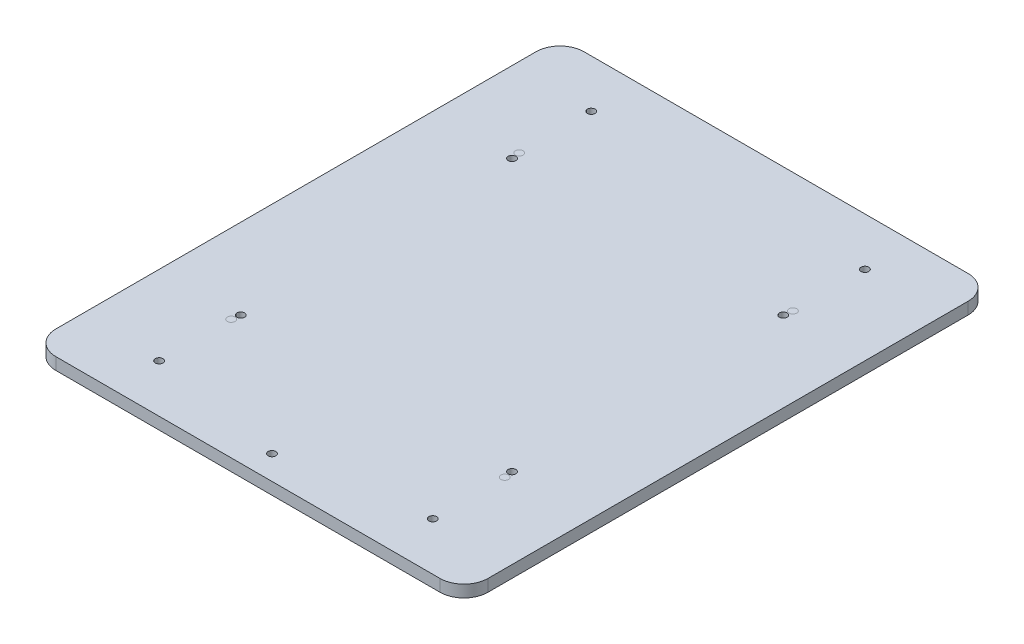
ISO-10303-21;
HEADER;
FILE_DESCRIPTION(('STEP AP214'),'2;1');
FILE_NAME('part.step','',(''),(''),'','','');
FILE_SCHEMA(('AUTOMOTIVE_DESIGN { 1 0 10303 214 1 1 1 1 }'));
ENDSEC;
DATA;
#1=APPLICATION_CONTEXT('core data for automotive mechanical design processes');
#2=APPLICATION_PROTOCOL_DEFINITION('international standard','automotive_design',2000,#1);
#3=PRODUCT_CONTEXT('',#1,'mechanical');
#4=PRODUCT('Part','Part','',(#3));
#5=PRODUCT_RELATED_PRODUCT_CATEGORY('part','',(#4));
#6=PRODUCT_DEFINITION_FORMATION('','',#4);
#7=PRODUCT_DEFINITION_CONTEXT('part definition',#1,'design');
#8=PRODUCT_DEFINITION('design','',#6,#7);
#9=PRODUCT_DEFINITION_SHAPE('','',#8);
#10=(LENGTH_UNIT() NAMED_UNIT(*) SI_UNIT(.MILLI.,.METRE.));
#11=(NAMED_UNIT(*) PLANE_ANGLE_UNIT() SI_UNIT($,.RADIAN.));
#12=(NAMED_UNIT(*) SI_UNIT($,.STERADIAN.) SOLID_ANGLE_UNIT());
#13=UNCERTAINTY_MEASURE_WITH_UNIT(LENGTH_MEASURE(1.E-05),#10,'distance_accuracy_value','');
#14=(GEOMETRIC_REPRESENTATION_CONTEXT(3) GLOBAL_UNCERTAINTY_ASSIGNED_CONTEXT((#13)) GLOBAL_UNIT_ASSIGNED_CONTEXT((#10,
#11,#12)) REPRESENTATION_CONTEXT('',''));
#15=CARTESIAN_POINT('',(0.,0.,0.));
#16=DIRECTION('',(0.,0.,1.));
#17=DIRECTION('',(1.,0.,0.));
#18=AXIS2_PLACEMENT_3D('',#15,#16,#17);
#19=CARTESIAN_POINT('',(-81.074074074074,0.,84.6588693957116));
#20=DIRECTION('',(0.,1.,0.));
#21=DIRECTION('',(0.,0.,1.));
#22=AXIS2_PLACEMENT_3D('',#19,#20,#21);
#23=CYLINDRICAL_SURFACE('',#22,1.60000000000001);
#24=CARTESIAN_POINT('',(-81.074074074074,0.,84.6588693957116));
#25=DIRECTION('',(0.,1.,0.));
#26=DIRECTION('',(0.,0.,1.));
#27=AXIS2_PLACEMENT_3D('',#24,#25,#26);
#28=CIRCLE('',#27,1.60000000000001);
#29=CARTESIAN_POINT('',(-81.074074074074,0.,86.2588693957116));
#30=VERTEX_POINT('',#29);
#31=EDGE_CURVE('E11',#30,#30,#28,.T.);
#32=ORIENTED_EDGE('',*,*,#31,.T.);
#33=EDGE_LOOP('',(#32));
#34=FACE_BOUND('',#33,.T.);
#35=CARTESIAN_POINT('',(-81.074074074074,5.,84.6588693957116));
#36=DIRECTION('',(0.,1.,0.));
#37=DIRECTION('',(0.,0.,1.));
#38=AXIS2_PLACEMENT_3D('',#35,#36,#37);
#39=CIRCLE('',#38,1.60000000000001);
#40=CARTESIAN_POINT('',(-81.074074074074,5.,86.2588693957116));
#41=VERTEX_POINT('',#40);
#42=EDGE_CURVE('E49',#41,#41,#39,.T.);
#43=ORIENTED_EDGE('',*,*,#42,.F.);
#44=EDGE_LOOP('',(#43));
#45=FACE_BOUND('',#44,.T.);
#46=ADVANCED_FACE('F46',(#34,#45),#23,.T.);
#47=CARTESIAN_POINT('',(-81.074074074074,0.,84.6588693957116));
#48=DIRECTION('',(0.,1.,0.));
#49=DIRECTION('',(0.,0.,1.));
#50=AXIS2_PLACEMENT_3D('',#47,#48,#49);
#51=PLANE('',#50);
#52=ORIENTED_EDGE('',*,*,#31,.F.);
#53=EDGE_LOOP('',(#52));
#54=FACE_BOUND('',#53,.T.);
#55=ADVANCED_FACE('F61',(#54),#51,.F.);
#56=CARTESIAN_POINT('',(-81.074074074074,5.,84.6588693957116));
#57=DIRECTION('',(0.,1.,0.));
#58=DIRECTION('',(0.,0.,1.));
#59=AXIS2_PLACEMENT_3D('',#56,#57,#58);
#60=PLANE('',#59);
#61=ORIENTED_EDGE('',*,*,#42,.T.);
#62=EDGE_LOOP('',(#61));
#63=FACE_BOUND('',#62,.T.);
#64=ADVANCED_FACE('F58',(#63),#60,.T.);
#65=CLOSED_SHELL('',(#46,#55,#64));
#66=MANIFOLD_SOLID_BREP('B2',#65);
#67=CARTESIAN_POINT('',(32.925925925926,0.,84.6588693957116));
#68=DIRECTION('',(0.,1.,0.));
#69=DIRECTION('',(0.,0.,1.));
#70=AXIS2_PLACEMENT_3D('',#67,#68,#69);
#71=CYLINDRICAL_SURFACE('',#70,1.60000000000001);
#72=CARTESIAN_POINT('',(32.925925925926,0.,84.6588693957116));
#73=DIRECTION('',(0.,1.,0.));
#74=DIRECTION('',(0.,0.,1.));
#75=AXIS2_PLACEMENT_3D('',#72,#73,#74);
#76=CIRCLE('',#75,1.60000000000001);
#77=CARTESIAN_POINT('',(32.925925925926,0.,86.2588693957116));
#78=VERTEX_POINT('',#77);
#79=EDGE_CURVE('E45',#78,#78,#76,.T.);
#80=ORIENTED_EDGE('',*,*,#79,.T.);
#81=EDGE_LOOP('',(#80));
#82=FACE_BOUND('',#81,.T.);
#83=CARTESIAN_POINT('',(32.925925925926,5.,84.6588693957116));
#84=DIRECTION('',(0.,1.,0.));
#85=DIRECTION('',(0.,0.,1.));
#86=AXIS2_PLACEMENT_3D('',#83,#84,#85);
#87=CIRCLE('',#86,1.60000000000001);
#88=CARTESIAN_POINT('',(32.925925925926,5.,86.2588693957116));
#89=VERTEX_POINT('',#88);
#90=EDGE_CURVE('E98',#89,#89,#87,.T.);
#91=ORIENTED_EDGE('',*,*,#90,.F.);
#92=EDGE_LOOP('',(#91));
#93=FACE_BOUND('',#92,.T.);
#94=ADVANCED_FACE('F95',(#82,#93),#71,.T.);
#95=CARTESIAN_POINT('',(32.925925925926,0.,84.6588693957116));
#96=DIRECTION('',(0.,1.,0.));
#97=DIRECTION('',(0.,0.,1.));
#98=AXIS2_PLACEMENT_3D('',#95,#96,#97);
#99=PLANE('',#98);
#100=ORIENTED_EDGE('',*,*,#79,.F.);
#101=EDGE_LOOP('',(#100));
#102=FACE_BOUND('',#101,.T.);
#103=ADVANCED_FACE('F110',(#102),#99,.F.);
#104=CARTESIAN_POINT('',(32.925925925926,5.,84.6588693957116));
#105=DIRECTION('',(0.,1.,0.));
#106=DIRECTION('',(0.,0.,1.));
#107=AXIS2_PLACEMENT_3D('',#104,#105,#106);
#108=PLANE('',#107);
#109=ORIENTED_EDGE('',*,*,#90,.T.);
#110=EDGE_LOOP('',(#109));
#111=FACE_BOUND('',#110,.T.);
#112=ADVANCED_FACE('F107',(#111),#108,.T.);
#113=CLOSED_SHELL('',(#94,#103,#112));
#114=MANIFOLD_SOLID_BREP('B6',#113);
#115=CARTESIAN_POINT('',(32.925925925926,0.,-35.3411306042884));
#116=DIRECTION('',(0.,1.,0.));
#117=DIRECTION('',(0.,0.,1.));
#118=AXIS2_PLACEMENT_3D('',#115,#116,#117);
#119=CYLINDRICAL_SURFACE('',#118,1.59999999999999);
#120=CARTESIAN_POINT('',(32.925925925926,0.,-35.3411306042884));
#121=DIRECTION('',(0.,1.,0.));
#122=DIRECTION('',(0.,0.,1.));
#123=AXIS2_PLACEMENT_3D('',#120,#121,#122);
#124=CIRCLE('',#123,1.59999999999999);
#125=CARTESIAN_POINT('',(32.925925925926,0.,-33.7411306042884));
#126=VERTEX_POINT('',#125);
#127=EDGE_CURVE('E94',#126,#126,#124,.T.);
#128=ORIENTED_EDGE('',*,*,#127,.T.);
#129=EDGE_LOOP('',(#128));
#130=FACE_BOUND('',#129,.T.);
#131=CARTESIAN_POINT('',(32.925925925926,5.,-35.3411306042884));
#132=DIRECTION('',(0.,1.,0.));
#133=DIRECTION('',(0.,0.,1.));
#134=AXIS2_PLACEMENT_3D('',#131,#132,#133);
#135=CIRCLE('',#134,1.59999999999999);
#136=CARTESIAN_POINT('',(32.925925925926,5.,-33.7411306042884));
#137=VERTEX_POINT('',#136);
#138=EDGE_CURVE('E147',#137,#137,#135,.T.);
#139=ORIENTED_EDGE('',*,*,#138,.F.);
#140=EDGE_LOOP('',(#139));
#141=FACE_BOUND('',#140,.T.);
#142=ADVANCED_FACE('F144',(#130,#141),#119,.T.);
#143=CARTESIAN_POINT('',(32.925925925926,0.,-35.3411306042884));
#144=DIRECTION('',(0.,1.,0.));
#145=DIRECTION('',(0.,0.,1.));
#146=AXIS2_PLACEMENT_3D('',#143,#144,#145);
#147=PLANE('',#146);
#148=ORIENTED_EDGE('',*,*,#127,.F.);
#149=EDGE_LOOP('',(#148));
#150=FACE_BOUND('',#149,.T.);
#151=ADVANCED_FACE('F159',(#150),#147,.F.);
#152=CARTESIAN_POINT('',(32.925925925926,5.,-35.3411306042884));
#153=DIRECTION('',(0.,1.,0.));
#154=DIRECTION('',(0.,0.,1.));
#155=AXIS2_PLACEMENT_3D('',#152,#153,#154);
#156=PLANE('',#155);
#157=ORIENTED_EDGE('',*,*,#138,.T.);
#158=EDGE_LOOP('',(#157));
#159=FACE_BOUND('',#158,.T.);
#160=ADVANCED_FACE('F156',(#159),#156,.T.);
#161=CLOSED_SHELL('',(#142,#151,#160));
#162=MANIFOLD_SOLID_BREP('B40',#161);
#163=CARTESIAN_POINT('',(-81.074074074074,0.,-35.3411306042884));
#164=DIRECTION('',(0.,1.,0.));
#165=DIRECTION('',(0.,0.,1.));
#166=AXIS2_PLACEMENT_3D('',#163,#164,#165);
#167=CYLINDRICAL_SURFACE('',#166,1.6);
#168=CARTESIAN_POINT('',(-81.074074074074,0.,-35.3411306042884));
#169=DIRECTION('',(0.,1.,0.));
#170=DIRECTION('',(0.,0.,1.));
#171=AXIS2_PLACEMENT_3D('',#168,#169,#170);
#172=CIRCLE('',#171,1.6);
#173=CARTESIAN_POINT('',(-81.074074074074,0.,-33.7411306042884));
#174=VERTEX_POINT('',#173);
#175=EDGE_CURVE('E143',#174,#174,#172,.T.);
#176=ORIENTED_EDGE('',*,*,#175,.T.);
#177=EDGE_LOOP('',(#176));
#178=FACE_BOUND('',#177,.T.);
#179=CARTESIAN_POINT('',(-81.074074074074,5.,-35.3411306042884));
#180=DIRECTION('',(0.,1.,0.));
#181=DIRECTION('',(0.,0.,1.));
#182=AXIS2_PLACEMENT_3D('',#179,#180,#181);
#183=CIRCLE('',#182,1.6);
#184=CARTESIAN_POINT('',(-81.074074074074,5.,-33.7411306042884));
#185=VERTEX_POINT('',#184);
#186=EDGE_CURVE('E197',#185,#185,#183,.T.);
#187=ORIENTED_EDGE('',*,*,#186,.F.);
#188=EDGE_LOOP('',(#187));
#189=FACE_BOUND('',#188,.T.);
#190=ADVANCED_FACE('F194',(#178,#189),#167,.T.);
#191=CARTESIAN_POINT('',(-81.074074074074,0.,-35.3411306042884));
#192=DIRECTION('',(0.,1.,0.));
#193=DIRECTION('',(0.,0.,1.));
#194=AXIS2_PLACEMENT_3D('',#191,#192,#193);
#195=PLANE('',#194);
#196=ORIENTED_EDGE('',*,*,#175,.F.);
#197=EDGE_LOOP('',(#196));
#198=FACE_BOUND('',#197,.T.);
#199=ADVANCED_FACE('F209',(#198),#195,.F.);
#200=CARTESIAN_POINT('',(-81.074074074074,5.,-35.3411306042884));
#201=DIRECTION('',(0.,1.,0.));
#202=DIRECTION('',(0.,0.,1.));
#203=AXIS2_PLACEMENT_3D('',#200,#201,#202);
#204=PLANE('',#203);
#205=ORIENTED_EDGE('',*,*,#186,.T.);
#206=EDGE_LOOP('',(#205));
#207=FACE_BOUND('',#206,.T.);
#208=ADVANCED_FACE('F206',(#207),#204,.T.);
#209=CLOSED_SHELL('',(#190,#199,#208));
#210=MANIFOLD_SOLID_BREP('B89',#209);
#211=CARTESIAN_POINT('',(-104.074074074074,5.,-75.3411306042884));
#212=DIRECTION('',(0.,1.,0.));
#213=DIRECTION('',(0.,0.,1.));
#214=AXIS2_PLACEMENT_3D('',#211,#212,#213);
#215=PLANE('',#214);
#216=CARTESIAN_POINT('',(-24.074074074074,5.,124.658869395712));
#217=DIRECTION('',(0.,-1.,0.));
#218=DIRECTION('',(0.,0.,-1.));
#219=AXIS2_PLACEMENT_3D('',#216,#217,#218);
#220=CIRCLE('',#219,1.6);
#221=CARTESIAN_POINT('',(-24.074074074074,5.,123.058869395712));
#222=VERTEX_POINT('',#221);
#223=EDGE_CURVE('E533',#222,#222,#220,.T.);
#224=ORIENTED_EDGE('',*,*,#223,.T.);
#225=EDGE_LOOP('',(#224));
#226=FACE_BOUND('',#225,.T.);
#227=CARTESIAN_POINT('',(32.425925925926,5.,81.1588693957116));
#228=DIRECTION('',(0.,1.,0.));
#229=DIRECTION('',(0.,0.,1.));
#230=AXIS2_PLACEMENT_3D('',#227,#228,#229);
#231=CIRCLE('',#230,1.6);
#232=CARTESIAN_POINT('',(32.425925925926,5.,82.7588693957116));
#233=VERTEX_POINT('',#232);
#234=EDGE_CURVE('E540',#233,#233,#231,.T.);
#235=ORIENTED_EDGE('',*,*,#234,.F.);
#236=EDGE_LOOP('',(#235));
#237=FACE_BOUND('',#236,.T.);
#238=CARTESIAN_POINT('',(32.425925925926,5.,-31.8411306042884));
#239=DIRECTION('',(0.,1.,0.));
#240=DIRECTION('',(0.,0.,1.));
#241=AXIS2_PLACEMENT_3D('',#238,#239,#240);
#242=CIRCLE('',#241,1.6);
#243=CARTESIAN_POINT('',(32.425925925926,5.,-30.2411306042884));
#244=VERTEX_POINT('',#243);
#245=EDGE_CURVE('E556',#244,#244,#242,.T.);
#246=ORIENTED_EDGE('',*,*,#245,.F.);
#247=EDGE_LOOP('',(#246));
#248=FACE_BOUND('',#247,.T.);
#249=CARTESIAN_POINT('',(-80.574074074074,5.,-31.8411306042884));
#250=DIRECTION('',(0.,1.,0.));
#251=DIRECTION('',(0.,0.,1.));
#252=AXIS2_PLACEMENT_3D('',#249,#250,#251);
#253=CIRCLE('',#252,1.60000000000001);
#254=CARTESIAN_POINT('',(-80.574074074074,5.,-30.2411306042884));
#255=VERTEX_POINT('',#254);
#256=EDGE_CURVE('E548',#255,#255,#253,.T.);
#257=ORIENTED_EDGE('',*,*,#256,.F.);
#258=EDGE_LOOP('',(#257));
#259=FACE_BOUND('',#258,.T.);
#260=CARTESIAN_POINT('',(-80.574074074074,5.,81.1588693957116));
#261=DIRECTION('',(0.,1.,0.));
#262=DIRECTION('',(0.,0.,1.));
#263=AXIS2_PLACEMENT_3D('',#260,#261,#262);
#264=CIRCLE('',#263,1.60000000000001);
#265=CARTESIAN_POINT('',(-80.574074074074,5.,82.7588693957116));
#266=VERTEX_POINT('',#265);
#267=EDGE_CURVE('E547',#266,#266,#264,.T.);
#268=ORIENTED_EDGE('',*,*,#267,.F.);
#269=EDGE_LOOP('',(#268));
#270=FACE_BOUND('',#269,.T.);
#271=CARTESIAN_POINT('',(-81.074074074074,5.,-65.3411306042884));
#272=DIRECTION('',(0.,1.,0.));
#273=DIRECTION('',(0.,0.,1.));
#274=AXIS2_PLACEMENT_3D('',#271,#272,#273);
#275=CIRCLE('',#274,1.60000000000001);
#276=CARTESIAN_POINT('',(-81.074074074074,5.,-63.7411306042884));
#277=VERTEX_POINT('',#276);
#278=EDGE_CURVE('E571',#277,#277,#275,.T.);
#279=ORIENTED_EDGE('',*,*,#278,.F.);
#280=EDGE_LOOP('',(#279));
#281=FACE_BOUND('',#280,.T.);
#282=CARTESIAN_POINT('',(32.925925925926,5.,-65.3411306042884));
#283=DIRECTION('',(0.,1.,0.));
#284=DIRECTION('',(0.,0.,1.));
#285=AXIS2_PLACEMENT_3D('',#282,#283,#284);
#286=CIRCLE('',#285,1.6);
#287=CARTESIAN_POINT('',(32.925925925926,5.,-63.7411306042884));
#288=VERTEX_POINT('',#287);
#289=EDGE_CURVE('E579',#288,#288,#286,.T.);
#290=ORIENTED_EDGE('',*,*,#289,.F.);
#291=EDGE_LOOP('',(#290));
#292=FACE_BOUND('',#291,.T.);
#293=CARTESIAN_POINT('',(32.925925925926,5.,114.658869395712));
#294=DIRECTION('',(0.,1.,0.));
#295=DIRECTION('',(0.,0.,1.));
#296=AXIS2_PLACEMENT_3D('',#293,#294,#295);
#297=CIRCLE('',#296,1.6);
#298=CARTESIAN_POINT('',(32.925925925926,5.,116.258869395712));
#299=VERTEX_POINT('',#298);
#300=EDGE_CURVE('E575',#299,#299,#297,.T.);
#301=ORIENTED_EDGE('',*,*,#300,.F.);
#302=EDGE_LOOP('',(#301));
#303=FACE_BOUND('',#302,.T.);
#304=CARTESIAN_POINT('',(-81.074074074074,5.,114.658869395712));
#305=DIRECTION('',(0.,1.,0.));
#306=DIRECTION('',(0.,0.,1.));
#307=AXIS2_PLACEMENT_3D('',#304,#305,#306);
#308=CIRCLE('',#307,1.60000000000001);
#309=CARTESIAN_POINT('',(-81.074074074074,5.,116.258869395712));
#310=VERTEX_POINT('',#309);
#311=EDGE_CURVE('E385',#310,#310,#308,.T.);
#312=ORIENTED_EDGE('',*,*,#311,.F.);
#313=EDGE_LOOP('',(#312));
#314=FACE_BOUND('',#313,.T.);
#315=CARTESIAN_POINT('',(32.925925925926,5.,84.6588693957116));
#316=DIRECTION('',(0.,1.,0.));
#317=DIRECTION('',(0.,0.,1.));
#318=AXIS2_PLACEMENT_3D('',#315,#316,#317);
#319=CIRCLE('',#318,1.6);
#320=CARTESIAN_POINT('',(32.925925925926,5.,86.2588693957116));
#321=VERTEX_POINT('',#320);
#322=EDGE_CURVE('E410',#321,#321,#319,.T.);
#323=ORIENTED_EDGE('',*,*,#322,.F.);
#324=EDGE_LOOP('',(#323));
#325=FACE_BOUND('',#324,.T.);
#326=CARTESIAN_POINT('',(-81.074074074074,5.,-35.3411306042884));
#327=DIRECTION('',(0.,1.,0.));
#328=DIRECTION('',(0.,0.,1.));
#329=AXIS2_PLACEMENT_3D('',#326,#327,#328);
#330=CIRCLE('',#329,1.60000000000001);
#331=CARTESIAN_POINT('',(-81.074074074074,5.,-33.7411306042884));
#332=VERTEX_POINT('',#331);
#333=EDGE_CURVE('E344',#332,#332,#330,.T.);
#334=ORIENTED_EDGE('',*,*,#333,.F.);
#335=EDGE_LOOP('',(#334));
#336=FACE_BOUND('',#335,.T.);
#337=CARTESIAN_POINT('',(-104.074074074074,5.,-75.3411306042884));
#338=DIRECTION('',(0.,1.,0.));
#339=DIRECTION('',(0.,0.,1.));
#340=AXIS2_PLACEMENT_3D('',#337,#338,#339);
#341=CIRCLE('',#340,9.99999999999999);
#342=CARTESIAN_POINT('',(-104.074074074074,5.,-85.3411306042884));
#343=VERTEX_POINT('',#342);
#344=CARTESIAN_POINT('',(-114.074074074074,5.,-75.3411306042883));
#345=VERTEX_POINT('',#344);
#346=EDGE_CURVE('E362',#343,#345,#341,.T.);
#347=ORIENTED_EDGE('',*,*,#346,.T.);
#348=DIRECTION('',(0.,0.,1.));
#349=VECTOR('',#348,1.);
#350=CARTESIAN_POINT('',(-114.074074074074,5.,-75.3411306042883));
#351=LINE('',#350,#349);
#352=CARTESIAN_POINT('',(-114.074074074074,5.,124.658869395712));
#353=VERTEX_POINT('',#352);
#354=EDGE_CURVE('E298',#345,#353,#351,.T.);
#355=ORIENTED_EDGE('',*,*,#354,.T.);
#356=CARTESIAN_POINT('',(-104.074074074074,5.,124.658869395712));
#357=DIRECTION('',(0.,1.,0.));
#358=DIRECTION('',(0.,0.,1.));
#359=AXIS2_PLACEMENT_3D('',#356,#357,#358);
#360=CIRCLE('',#359,9.99999999999999);
#361=CARTESIAN_POINT('',(-104.074074074074,5.,134.658869395712));
#362=VERTEX_POINT('',#361);
#363=EDGE_CURVE('E436',#353,#362,#360,.T.);
#364=ORIENTED_EDGE('',*,*,#363,.T.);
#365=DIRECTION('',(1.,0.,0.));
#366=VECTOR('',#365,1.);
#367=CARTESIAN_POINT('',(-104.074074074074,5.,134.658869395712));
#368=LINE('',#367,#366);
#369=CARTESIAN_POINT('',(55.9259259259259,5.,134.658869395712));
#370=VERTEX_POINT('',#369);
#371=EDGE_CURVE('E439',#362,#370,#368,.T.);
#372=ORIENTED_EDGE('',*,*,#371,.T.);
#373=CARTESIAN_POINT('',(55.925925925926,5.,124.658869395712));
#374=DIRECTION('',(0.,1.,0.));
#375=DIRECTION('',(0.,0.,1.));
#376=AXIS2_PLACEMENT_3D('',#373,#374,#375);
#377=CIRCLE('',#376,9.99999999999999);
#378=CARTESIAN_POINT('',(65.925925925926,5.,124.658869395712));
#379=VERTEX_POINT('',#378);
#380=EDGE_CURVE('E317',#370,#379,#377,.T.);
#381=ORIENTED_EDGE('',*,*,#380,.T.);
#382=DIRECTION('',(0.,0.,-1.));
#383=VECTOR('',#382,1.);
#384=CARTESIAN_POINT('',(65.925925925926,5.,-75.3411306042883));
#385=LINE('',#384,#383);
#386=CARTESIAN_POINT('',(65.925925925926,5.,-75.3411306042883));
#387=VERTEX_POINT('',#386);
#388=EDGE_CURVE('E311',#379,#387,#385,.T.);
#389=ORIENTED_EDGE('',*,*,#388,.T.);
#390=CARTESIAN_POINT('',(55.925925925926,5.,-75.3411306042884));
#391=DIRECTION('',(0.,1.,0.));
#392=DIRECTION('',(0.,0.,-1.));
#393=AXIS2_PLACEMENT_3D('',#390,#391,#392);
#394=CIRCLE('',#393,9.99999999999999);
#395=CARTESIAN_POINT('',(55.9259259259259,5.,-85.3411306042884));
#396=VERTEX_POINT('',#395);
#397=EDGE_CURVE('E315',#387,#396,#394,.T.);
#398=ORIENTED_EDGE('',*,*,#397,.T.);
#399=DIRECTION('',(-1.,0.,0.));
#400=VECTOR('',#399,1.);
#401=CARTESIAN_POINT('',(-104.074074074074,5.,-85.3411306042884));
#402=LINE('',#401,#400);
#403=EDGE_CURVE('E255',#396,#343,#402,.T.);
#404=ORIENTED_EDGE('',*,*,#403,.T.);
#405=EDGE_LOOP('',(#347,#355,#364,#372,#381,#389,#398,#404));
#406=FACE_BOUND('',#405,.T.);
#407=CARTESIAN_POINT('',(32.925925925926,5.,-35.3411306042884));
#408=DIRECTION('',(0.,1.,0.));
#409=DIRECTION('',(0.,0.,1.));
#410=AXIS2_PLACEMENT_3D('',#407,#408,#409);
#411=CIRCLE('',#410,1.6);
#412=CARTESIAN_POINT('',(32.925925925926,5.,-33.7411306042884));
#413=VERTEX_POINT('',#412);
#414=EDGE_CURVE('E418',#413,#413,#411,.T.);
#415=ORIENTED_EDGE('',*,*,#414,.F.);
#416=EDGE_LOOP('',(#415));
#417=FACE_BOUND('',#416,.T.);
#418=CARTESIAN_POINT('',(-81.074074074074,5.,84.6588693957116));
#419=DIRECTION('',(0.,1.,0.));
#420=DIRECTION('',(0.,0.,1.));
#421=AXIS2_PLACEMENT_3D('',#418,#419,#420);
#422=CIRCLE('',#421,1.60000000000001);
#423=CARTESIAN_POINT('',(-81.074074074074,5.,86.2588693957116));
#424=VERTEX_POINT('',#423);
#425=EDGE_CURVE('E400',#424,#424,#422,.T.);
#426=ORIENTED_EDGE('',*,*,#425,.F.);
#427=EDGE_LOOP('',(#426));
#428=FACE_BOUND('',#427,.T.);
#429=ADVANCED_FACE('F235',(#226,#237,#248,#259,#270,#281,#292,#303,#314,#325,#336,#406,#417,
#428),#215,.T.);
#430=CARTESIAN_POINT('',(-104.074074074074,0.,-75.3411306042884));
#431=DIRECTION('',(0.,1.,0.));
#432=DIRECTION('',(0.,0.,1.));
#433=AXIS2_PLACEMENT_3D('',#430,#431,#432);
#434=PLANE('',#433);
#435=CARTESIAN_POINT('',(-24.074074074074,0.,124.658869395712));
#436=DIRECTION('',(0.,-1.,0.));
#437=DIRECTION('',(0.,0.,-1.));
#438=AXIS2_PLACEMENT_3D('',#435,#436,#437);
#439=CIRCLE('',#438,1.6);
#440=CARTESIAN_POINT('',(-24.074074074074,0.,123.058869395712));
#441=VERTEX_POINT('',#440);
#442=EDGE_CURVE('E536',#441,#441,#439,.T.);
#443=ORIENTED_EDGE('',*,*,#442,.F.);
#444=EDGE_LOOP('',(#443));
#445=FACE_BOUND('',#444,.T.);
#446=CARTESIAN_POINT('',(32.425925925926,0.,81.1588693957116));
#447=DIRECTION('',(0.,1.,0.));
#448=DIRECTION('',(0.,0.,1.));
#449=AXIS2_PLACEMENT_3D('',#446,#447,#448);
#450=CIRCLE('',#449,1.6);
#451=CARTESIAN_POINT('',(32.425925925926,0.,82.7588693957116));
#452=VERTEX_POINT('',#451);
#453=EDGE_CURVE('E560',#452,#452,#450,.T.);
#454=ORIENTED_EDGE('',*,*,#453,.T.);
#455=EDGE_LOOP('',(#454));
#456=FACE_BOUND('',#455,.T.);
#457=CARTESIAN_POINT('',(32.425925925926,0.,-31.8411306042884));
#458=DIRECTION('',(0.,1.,0.));
#459=DIRECTION('',(0.,0.,1.));
#460=AXIS2_PLACEMENT_3D('',#457,#458,#459);
#461=CIRCLE('',#460,1.6);
#462=CARTESIAN_POINT('',(32.425925925926,0.,-30.2411306042884));
#463=VERTEX_POINT('',#462);
#464=EDGE_CURVE('E552',#463,#463,#461,.T.);
#465=ORIENTED_EDGE('',*,*,#464,.T.);
#466=EDGE_LOOP('',(#465));
#467=FACE_BOUND('',#466,.T.);
#468=CARTESIAN_POINT('',(-80.574074074074,0.,-31.8411306042884));
#469=DIRECTION('',(0.,1.,0.));
#470=DIRECTION('',(0.,0.,1.));
#471=AXIS2_PLACEMENT_3D('',#468,#469,#470);
#472=CIRCLE('',#471,1.60000000000001);
#473=CARTESIAN_POINT('',(-80.574074074074,0.,-30.2411306042884));
#474=VERTEX_POINT('',#473);
#475=EDGE_CURVE('E543',#474,#474,#472,.T.);
#476=ORIENTED_EDGE('',*,*,#475,.T.);
#477=EDGE_LOOP('',(#476));
#478=FACE_BOUND('',#477,.T.);
#479=CARTESIAN_POINT('',(-80.574074074074,0.,81.1588693957116));
#480=DIRECTION('',(0.,1.,0.));
#481=DIRECTION('',(0.,0.,1.));
#482=AXIS2_PLACEMENT_3D('',#479,#480,#481);
#483=CIRCLE('',#482,1.60000000000001);
#484=CARTESIAN_POINT('',(-80.574074074074,0.,82.7588693957116));
#485=VERTEX_POINT('',#484);
#486=EDGE_CURVE('E567',#485,#485,#483,.T.);
#487=ORIENTED_EDGE('',*,*,#486,.T.);
#488=EDGE_LOOP('',(#487));
#489=FACE_BOUND('',#488,.T.);
#490=CARTESIAN_POINT('',(-81.074074074074,0.,-65.3411306042884));
#491=DIRECTION('',(0.,1.,0.));
#492=DIRECTION('',(0.,0.,1.));
#493=AXIS2_PLACEMENT_3D('',#490,#491,#492);
#494=CIRCLE('',#493,1.60000000000001);
#495=CARTESIAN_POINT('',(-81.074074074074,0.,-63.7411306042884));
#496=VERTEX_POINT('',#495);
#497=EDGE_CURVE('E239',#496,#496,#494,.T.);
#498=ORIENTED_EDGE('',*,*,#497,.T.);
#499=EDGE_LOOP('',(#498));
#500=FACE_BOUND('',#499,.T.);
#501=CARTESIAN_POINT('',(32.925925925926,0.,-65.3411306042884));
#502=DIRECTION('',(0.,1.,0.));
#503=DIRECTION('',(0.,0.,1.));
#504=AXIS2_PLACEMENT_3D('',#501,#502,#503);
#505=CIRCLE('',#504,1.6);
#506=CARTESIAN_POINT('',(32.925925925926,0.,-63.7411306042884));
#507=VERTEX_POINT('',#506);
#508=EDGE_CURVE('E388',#507,#507,#505,.T.);
#509=ORIENTED_EDGE('',*,*,#508,.T.);
#510=EDGE_LOOP('',(#509));
#511=FACE_BOUND('',#510,.T.);
#512=CARTESIAN_POINT('',(32.925925925926,0.,114.658869395712));
#513=DIRECTION('',(0.,1.,0.));
#514=DIRECTION('',(0.,0.,1.));
#515=AXIS2_PLACEMENT_3D('',#512,#513,#514);
#516=CIRCLE('',#515,1.6);
#517=CARTESIAN_POINT('',(32.925925925926,0.,116.258869395712));
#518=VERTEX_POINT('',#517);
#519=EDGE_CURVE('E384',#518,#518,#516,.T.);
#520=ORIENTED_EDGE('',*,*,#519,.T.);
#521=EDGE_LOOP('',(#520));
#522=FACE_BOUND('',#521,.T.);
#523=CARTESIAN_POINT('',(-81.074074074074,0.,114.658869395712));
#524=DIRECTION('',(0.,1.,0.));
#525=DIRECTION('',(0.,0.,1.));
#526=AXIS2_PLACEMENT_3D('',#523,#524,#525);
#527=CIRCLE('',#526,1.60000000000001);
#528=CARTESIAN_POINT('',(-81.074074074074,0.,116.258869395712));
#529=VERTEX_POINT('',#528);
#530=EDGE_CURVE('E380',#529,#529,#527,.T.);
#531=ORIENTED_EDGE('',*,*,#530,.T.);
#532=EDGE_LOOP('',(#531));
#533=FACE_BOUND('',#532,.T.);
#534=CARTESIAN_POINT('',(-104.074074074074,0.,-75.3411306042884));
#535=DIRECTION('',(0.,1.,0.));
#536=DIRECTION('',(0.,0.,1.));
#537=AXIS2_PLACEMENT_3D('',#534,#535,#536);
#538=CIRCLE('',#537,9.99999999999999);
#539=CARTESIAN_POINT('',(-104.074074074074,0.,-85.3411306042884));
#540=VERTEX_POINT('',#539);
#541=CARTESIAN_POINT('',(-114.074074074074,0.,-75.3411306042883));
#542=VERTEX_POINT('',#541);
#543=EDGE_CURVE('E339',#540,#542,#538,.T.);
#544=ORIENTED_EDGE('',*,*,#543,.F.);
#545=DIRECTION('',(-1.,0.,0.));
#546=VECTOR('',#545,1.);
#547=CARTESIAN_POINT('',(-104.074074074074,0.,-85.3411306042884));
#548=LINE('',#547,#546);
#549=CARTESIAN_POINT('',(55.9259259259259,0.,-85.3411306042884));
#550=VERTEX_POINT('',#549);
#551=EDGE_CURVE('E290',#550,#540,#548,.T.);
#552=ORIENTED_EDGE('',*,*,#551,.F.);
#553=CARTESIAN_POINT('',(55.925925925926,0.,-75.3411306042884));
#554=DIRECTION('',(0.,1.,0.));
#555=DIRECTION('',(0.,0.,-1.));
#556=AXIS2_PLACEMENT_3D('',#553,#554,#555);
#557=CIRCLE('',#556,9.99999999999999);
#558=CARTESIAN_POINT('',(65.925925925926,0.,-75.3411306042883));
#559=VERTEX_POINT('',#558);
#560=EDGE_CURVE('E284',#559,#550,#557,.T.);
#561=ORIENTED_EDGE('',*,*,#560,.F.);
#562=DIRECTION('',(0.,0.,-1.));
#563=VECTOR('',#562,1.);
#564=CARTESIAN_POINT('',(65.925925925926,0.,-75.3411306042883));
#565=LINE('',#564,#563);
#566=CARTESIAN_POINT('',(65.925925925926,0.,124.658869395712));
#567=VERTEX_POINT('',#566);
#568=EDGE_CURVE('E326',#567,#559,#565,.T.);
#569=ORIENTED_EDGE('',*,*,#568,.F.);
#570=CARTESIAN_POINT('',(55.925925925926,0.,124.658869395712));
#571=DIRECTION('',(0.,1.,0.));
#572=DIRECTION('',(0.,0.,1.));
#573=AXIS2_PLACEMENT_3D('',#570,#571,#572);
#574=CIRCLE('',#573,9.99999999999999);
#575=CARTESIAN_POINT('',(55.9259259259259,0.,134.658869395712));
#576=VERTEX_POINT('',#575);
#577=EDGE_CURVE('E353',#576,#567,#574,.T.);
#578=ORIENTED_EDGE('',*,*,#577,.F.);
#579=DIRECTION('',(1.,0.,0.));
#580=VECTOR('',#579,1.);
#581=CARTESIAN_POINT('',(-104.074074074074,0.,134.658869395712));
#582=LINE('',#581,#580);
#583=CARTESIAN_POINT('',(-104.074074074074,0.,134.658869395712));
#584=VERTEX_POINT('',#583);
#585=EDGE_CURVE('E350',#584,#576,#582,.T.);
#586=ORIENTED_EDGE('',*,*,#585,.F.);
#587=CARTESIAN_POINT('',(-104.074074074074,0.,124.658869395712));
#588=DIRECTION('',(0.,1.,0.));
#589=DIRECTION('',(0.,0.,1.));
#590=AXIS2_PLACEMENT_3D('',#587,#588,#589);
#591=CIRCLE('',#590,9.99999999999999);
#592=CARTESIAN_POINT('',(-114.074074074074,0.,124.658869395712));
#593=VERTEX_POINT('',#592);
#594=EDGE_CURVE('E347',#593,#584,#591,.T.);
#595=ORIENTED_EDGE('',*,*,#594,.F.);
#596=DIRECTION('',(0.,0.,1.));
#597=VECTOR('',#596,1.);
#598=CARTESIAN_POINT('',(-114.074074074074,0.,-75.3411306042883));
#599=LINE('',#598,#597);
#600=EDGE_CURVE('E343',#542,#593,#599,.T.);
#601=ORIENTED_EDGE('',*,*,#600,.F.);
#602=EDGE_LOOP('',(#544,#552,#561,#569,#578,#586,#595,#601));
#603=FACE_BOUND('',#602,.T.);
#604=CARTESIAN_POINT('',(-81.074074074074,0.,-35.3411306042884));
#605=DIRECTION('',(0.,1.,0.));
#606=DIRECTION('',(0.,0.,1.));
#607=AXIS2_PLACEMENT_3D('',#604,#605,#606);
#608=CIRCLE('',#607,1.60000000000001);
#609=CARTESIAN_POINT('',(-81.074074074074,0.,-33.7411306042884));
#610=VERTEX_POINT('',#609);
#611=EDGE_CURVE('E422',#610,#610,#608,.T.);
#612=ORIENTED_EDGE('',*,*,#611,.T.);
#613=EDGE_LOOP('',(#612));
#614=FACE_BOUND('',#613,.T.);
#615=CARTESIAN_POINT('',(32.925925925926,0.,-35.3411306042884));
#616=DIRECTION('',(0.,1.,0.));
#617=DIRECTION('',(0.,0.,1.));
#618=AXIS2_PLACEMENT_3D('',#615,#616,#617);
#619=CIRCLE('',#618,1.6);
#620=CARTESIAN_POINT('',(32.925925925926,0.,-33.7411306042884));
#621=VERTEX_POINT('',#620);
#622=EDGE_CURVE('E414',#621,#621,#619,.T.);
#623=ORIENTED_EDGE('',*,*,#622,.T.);
#624=EDGE_LOOP('',(#623));
#625=FACE_BOUND('',#624,.T.);
#626=CARTESIAN_POINT('',(32.925925925926,0.,84.6588693957116));
#627=DIRECTION('',(0.,1.,0.));
#628=DIRECTION('',(0.,0.,1.));
#629=AXIS2_PLACEMENT_3D('',#626,#627,#628);
#630=CIRCLE('',#629,1.6);
#631=CARTESIAN_POINT('',(32.925925925926,0.,86.2588693957116));
#632=VERTEX_POINT('',#631);
#633=EDGE_CURVE('E406',#632,#632,#630,.T.);
#634=ORIENTED_EDGE('',*,*,#633,.T.);
#635=EDGE_LOOP('',(#634));
#636=FACE_BOUND('',#635,.T.);
#637=CARTESIAN_POINT('',(-81.074074074074,0.,84.6588693957116));
#638=DIRECTION('',(0.,1.,0.));
#639=DIRECTION('',(0.,0.,1.));
#640=AXIS2_PLACEMENT_3D('',#637,#638,#639);
#641=CIRCLE('',#640,1.60000000000001);
#642=CARTESIAN_POINT('',(-81.074074074074,0.,86.2588693957116));
#643=VERTEX_POINT('',#642);
#644=EDGE_CURVE('E395',#643,#643,#641,.T.);
#645=ORIENTED_EDGE('',*,*,#644,.T.);
#646=EDGE_LOOP('',(#645));
#647=FACE_BOUND('',#646,.T.);
#648=ADVANCED_FACE('F454',(#445,#456,#467,#478,#489,#500,#511,#522,#533,#603,#614,#625,#636,
#647),#434,.F.);
#649=CARTESIAN_POINT('',(-104.074074074074,5.,-75.3411306042884));
#650=DIRECTION('',(0.,-1.,0.));
#651=DIRECTION('',(0.,0.,-1.));
#652=AXIS2_PLACEMENT_3D('',#649,#650,#651);
#653=CYLINDRICAL_SURFACE('',#652,9.99999999999999);
#654=ORIENTED_EDGE('',*,*,#543,.T.);
#655=DIRECTION('',(0.,-1.,0.));
#656=VECTOR('',#655,1.);
#657=CARTESIAN_POINT('',(-114.074074074074,5.,-75.3411306042883));
#658=LINE('',#657,#656);
#659=EDGE_CURVE('E192',#345,#542,#658,.T.);
#660=ORIENTED_EDGE('',*,*,#659,.F.);
#661=ORIENTED_EDGE('',*,*,#346,.F.);
#662=DIRECTION('',(0.,-1.,0.));
#663=VECTOR('',#662,1.);
#664=CARTESIAN_POINT('',(-104.074074074074,5.,-85.3411306042884));
#665=LINE('',#664,#663);
#666=EDGE_CURVE('E335',#343,#540,#665,.T.);
#667=ORIENTED_EDGE('',*,*,#666,.T.);
#668=EDGE_LOOP('',(#654,#660,#661,#667));
#669=FACE_BOUND('',#668,.T.);
#670=ADVANCED_FACE('F237',(#669),#653,.T.);
#671=CARTESIAN_POINT('',(-114.074074074074,5.,-75.3411306042883));
#672=DIRECTION('',(1.,0.,0.));
#673=DIRECTION('',(0.,0.,-1.));
#674=AXIS2_PLACEMENT_3D('',#671,#672,#673);
#675=PLANE('',#674);
#676=ORIENTED_EDGE('',*,*,#600,.T.);
#677=DIRECTION('',(0.,-1.,0.));
#678=VECTOR('',#677,1.);
#679=CARTESIAN_POINT('',(-114.074074074074,5.,124.658869395712));
#680=LINE('',#679,#678);
#681=EDGE_CURVE('E246',#353,#593,#680,.T.);
#682=ORIENTED_EDGE('',*,*,#681,.F.);
#683=ORIENTED_EDGE('',*,*,#354,.F.);
#684=ORIENTED_EDGE('',*,*,#659,.T.);
#685=EDGE_LOOP('',(#676,#682,#683,#684));
#686=FACE_BOUND('',#685,.T.);
#687=ADVANCED_FACE('F727',(#686),#675,.F.);
#688=CARTESIAN_POINT('',(-104.074074074074,5.,124.658869395712));
#689=DIRECTION('',(0.,-1.,0.));
#690=DIRECTION('',(0.,0.,-1.));
#691=AXIS2_PLACEMENT_3D('',#688,#689,#690);
#692=CYLINDRICAL_SURFACE('',#691,9.99999999999999);
#693=ORIENTED_EDGE('',*,*,#594,.T.);
#694=DIRECTION('',(0.,-1.,0.));
#695=VECTOR('',#694,1.);
#696=CARTESIAN_POINT('',(-104.074074074074,5.,134.658869395712));
#697=LINE('',#696,#695);
#698=EDGE_CURVE('E373',#362,#584,#697,.T.);
#699=ORIENTED_EDGE('',*,*,#698,.F.);
#700=ORIENTED_EDGE('',*,*,#363,.F.);
#701=ORIENTED_EDGE('',*,*,#681,.T.);
#702=EDGE_LOOP('',(#693,#699,#700,#701));
#703=FACE_BOUND('',#702,.T.);
#704=ADVANCED_FACE('F718',(#703),#692,.T.);
#705=CARTESIAN_POINT('',(-104.074074074074,5.,134.658869395712));
#706=DIRECTION('',(0.,0.,-1.));
#707=DIRECTION('',(-1.,0.,0.));
#708=AXIS2_PLACEMENT_3D('',#705,#706,#707);
#709=PLANE('',#708);
#710=ORIENTED_EDGE('',*,*,#585,.T.);
#711=DIRECTION('',(0.,-1.,0.));
#712=VECTOR('',#711,1.);
#713=CARTESIAN_POINT('',(55.9259259259259,5.,134.658869395712));
#714=LINE('',#713,#712);
#715=EDGE_CURVE('E369',#370,#576,#714,.T.);
#716=ORIENTED_EDGE('',*,*,#715,.F.);
#717=ORIENTED_EDGE('',*,*,#371,.F.);
#718=ORIENTED_EDGE('',*,*,#698,.T.);
#719=EDGE_LOOP('',(#710,#716,#717,#718));
#720=FACE_BOUND('',#719,.T.);
#721=ADVANCED_FACE('F447',(#720),#709,.F.);
#722=CARTESIAN_POINT('',(55.925925925926,5.,124.658869395712));
#723=DIRECTION('',(0.,-1.,0.));
#724=DIRECTION('',(0.,0.,-1.));
#725=AXIS2_PLACEMENT_3D('',#722,#723,#724);
#726=CYLINDRICAL_SURFACE('',#725,9.99999999999999);
#727=ORIENTED_EDGE('',*,*,#577,.T.);
#728=DIRECTION('',(0.,-1.,0.));
#729=VECTOR('',#728,1.);
#730=CARTESIAN_POINT('',(65.925925925926,5.,124.658869395712));
#731=LINE('',#730,#729);
#732=EDGE_CURVE('E328',#379,#567,#731,.T.);
#733=ORIENTED_EDGE('',*,*,#732,.F.);
#734=ORIENTED_EDGE('',*,*,#380,.F.);
#735=ORIENTED_EDGE('',*,*,#715,.T.);
#736=EDGE_LOOP('',(#727,#733,#734,#735));
#737=FACE_BOUND('',#736,.T.);
#738=ADVANCED_FACE('F451',(#737),#726,.T.);
#739=CARTESIAN_POINT('',(65.925925925926,5.,-75.3411306042883));
#740=DIRECTION('',(-1.,0.,0.));
#741=DIRECTION('',(0.,0.,1.));
#742=AXIS2_PLACEMENT_3D('',#739,#740,#741);
#743=PLANE('',#742);
#744=ORIENTED_EDGE('',*,*,#568,.T.);
#745=DIRECTION('',(0.,-1.,0.));
#746=VECTOR('',#745,1.);
#747=CARTESIAN_POINT('',(65.925925925926,5.,-75.3411306042883));
#748=LINE('',#747,#746);
#749=EDGE_CURVE('E323',#387,#559,#748,.T.);
#750=ORIENTED_EDGE('',*,*,#749,.F.);
#751=ORIENTED_EDGE('',*,*,#388,.F.);
#752=ORIENTED_EDGE('',*,*,#732,.T.);
#753=EDGE_LOOP('',(#744,#750,#751,#752));
#754=FACE_BOUND('',#753,.T.);
#755=ADVANCED_FACE('F324',(#754),#743,.F.);
#756=CARTESIAN_POINT('',(55.925925925926,5.,-75.3411306042884));
#757=DIRECTION('',(0.,-1.,0.));
#758=DIRECTION('',(0.,0.,-1.));
#759=AXIS2_PLACEMENT_3D('',#756,#757,#758);
#760=CYLINDRICAL_SURFACE('',#759,9.99999999999999);
#761=ORIENTED_EDGE('',*,*,#560,.T.);
#762=DIRECTION('',(0.,-1.,0.));
#763=VECTOR('',#762,1.);
#764=CARTESIAN_POINT('',(55.9259259259259,5.,-85.3411306042884));
#765=LINE('',#764,#763);
#766=EDGE_CURVE('E329',#396,#550,#765,.T.);
#767=ORIENTED_EDGE('',*,*,#766,.F.);
#768=ORIENTED_EDGE('',*,*,#397,.F.);
#769=ORIENTED_EDGE('',*,*,#749,.T.);
#770=EDGE_LOOP('',(#761,#767,#768,#769));
#771=FACE_BOUND('',#770,.T.);
#772=ADVANCED_FACE('F331',(#771),#760,.T.);
#773=CARTESIAN_POINT('',(-104.074074074074,5.,-85.3411306042884));
#774=DIRECTION('',(0.,0.,1.));
#775=DIRECTION('',(1.,0.,0.));
#776=AXIS2_PLACEMENT_3D('',#773,#774,#775);
#777=PLANE('',#776);
#778=ORIENTED_EDGE('',*,*,#551,.T.);
#779=ORIENTED_EDGE('',*,*,#666,.F.);
#780=ORIENTED_EDGE('',*,*,#403,.F.);
#781=ORIENTED_EDGE('',*,*,#766,.T.);
#782=EDGE_LOOP('',(#778,#779,#780,#781));
#783=FACE_BOUND('',#782,.T.);
#784=ADVANCED_FACE('F460',(#783),#777,.F.);
#785=CARTESIAN_POINT('',(-81.074074074074,5.,-35.3411306042884));
#786=DIRECTION('',(0.,-1.,0.));
#787=DIRECTION('',(0.,0.,-1.));
#788=AXIS2_PLACEMENT_3D('',#785,#786,#787);
#789=CYLINDRICAL_SURFACE('',#788,1.60000000000001);
#790=ORIENTED_EDGE('',*,*,#333,.T.);
#791=EDGE_LOOP('',(#790));
#792=FACE_BOUND('',#791,.T.);
#793=ORIENTED_EDGE('',*,*,#611,.F.);
#794=EDGE_LOOP('',(#793));
#795=FACE_BOUND('',#794,.T.);
#796=ADVANCED_FACE('F462',(#792,#795),#789,.F.);
#797=CARTESIAN_POINT('',(32.925925925926,5.,-35.3411306042884));
#798=DIRECTION('',(0.,-1.,0.));
#799=DIRECTION('',(0.,0.,-1.));
#800=AXIS2_PLACEMENT_3D('',#797,#798,#799);
#801=CYLINDRICAL_SURFACE('',#800,1.6);
#802=ORIENTED_EDGE('',*,*,#414,.T.);
#803=EDGE_LOOP('',(#802));
#804=FACE_BOUND('',#803,.T.);
#805=ORIENTED_EDGE('',*,*,#622,.F.);
#806=EDGE_LOOP('',(#805));
#807=FACE_BOUND('',#806,.T.);
#808=ADVANCED_FACE('F468',(#804,#807),#801,.F.);
#809=CARTESIAN_POINT('',(32.925925925926,5.,84.6588693957116));
#810=DIRECTION('',(0.,-1.,0.));
#811=DIRECTION('',(0.,0.,-1.));
#812=AXIS2_PLACEMENT_3D('',#809,#810,#811);
#813=CYLINDRICAL_SURFACE('',#812,1.6);
#814=ORIENTED_EDGE('',*,*,#322,.T.);
#815=EDGE_LOOP('',(#814));
#816=FACE_BOUND('',#815,.T.);
#817=ORIENTED_EDGE('',*,*,#633,.F.);
#818=EDGE_LOOP('',(#817));
#819=FACE_BOUND('',#818,.T.);
#820=ADVANCED_FACE('F485',(#816,#819),#813,.F.);
#821=CARTESIAN_POINT('',(-81.074074074074,5.,84.6588693957116));
#822=DIRECTION('',(0.,-1.,0.));
#823=DIRECTION('',(0.,0.,-1.));
#824=AXIS2_PLACEMENT_3D('',#821,#822,#823);
#825=CYLINDRICAL_SURFACE('',#824,1.60000000000001);
#826=ORIENTED_EDGE('',*,*,#425,.T.);
#827=EDGE_LOOP('',(#826));
#828=FACE_BOUND('',#827,.T.);
#829=ORIENTED_EDGE('',*,*,#644,.F.);
#830=EDGE_LOOP('',(#829));
#831=FACE_BOUND('',#830,.T.);
#832=ADVANCED_FACE('F489',(#828,#831),#825,.F.);
#833=CARTESIAN_POINT('',(-81.074074074074,-5.,114.658869395712));
#834=DIRECTION('',(0.,1.,0.));
#835=DIRECTION('',(0.,0.,1.));
#836=AXIS2_PLACEMENT_3D('',#833,#834,#835);
#837=CYLINDRICAL_SURFACE('',#836,1.60000000000001);
#838=ORIENTED_EDGE('',*,*,#311,.T.);
#839=EDGE_LOOP('',(#838));
#840=FACE_BOUND('',#839,.T.);
#841=ORIENTED_EDGE('',*,*,#530,.F.);
#842=EDGE_LOOP('',(#841));
#843=FACE_BOUND('',#842,.T.);
#844=ADVANCED_FACE('F493',(#840,#843),#837,.F.);
#845=CARTESIAN_POINT('',(32.925925925926,-5.,114.658869395712));
#846=DIRECTION('',(0.,1.,0.));
#847=DIRECTION('',(0.,0.,1.));
#848=AXIS2_PLACEMENT_3D('',#845,#846,#847);
#849=CYLINDRICAL_SURFACE('',#848,1.6);
#850=ORIENTED_EDGE('',*,*,#300,.T.);
#851=EDGE_LOOP('',(#850));
#852=FACE_BOUND('',#851,.T.);
#853=ORIENTED_EDGE('',*,*,#519,.F.);
#854=EDGE_LOOP('',(#853));
#855=FACE_BOUND('',#854,.T.);
#856=ADVANCED_FACE('F497',(#852,#855),#849,.F.);
#857=CARTESIAN_POINT('',(32.925925925926,-5.,-65.3411306042884));
#858=DIRECTION('',(0.,1.,0.));
#859=DIRECTION('',(0.,0.,1.));
#860=AXIS2_PLACEMENT_3D('',#857,#858,#859);
#861=CYLINDRICAL_SURFACE('',#860,1.6);
#862=ORIENTED_EDGE('',*,*,#289,.T.);
#863=EDGE_LOOP('',(#862));
#864=FACE_BOUND('',#863,.T.);
#865=ORIENTED_EDGE('',*,*,#508,.F.);
#866=EDGE_LOOP('',(#865));
#867=FACE_BOUND('',#866,.T.);
#868=ADVANCED_FACE('F503',(#864,#867),#861,.F.);
#869=CARTESIAN_POINT('',(-81.074074074074,-5.,-65.3411306042884));
#870=DIRECTION('',(0.,1.,0.));
#871=DIRECTION('',(0.,0.,1.));
#872=AXIS2_PLACEMENT_3D('',#869,#870,#871);
#873=CYLINDRICAL_SURFACE('',#872,1.60000000000001);
#874=ORIENTED_EDGE('',*,*,#278,.T.);
#875=EDGE_LOOP('',(#874));
#876=FACE_BOUND('',#875,.T.);
#877=ORIENTED_EDGE('',*,*,#497,.F.);
#878=EDGE_LOOP('',(#877));
#879=FACE_BOUND('',#878,.T.);
#880=ADVANCED_FACE('F499',(#876,#879),#873,.F.);
#881=CARTESIAN_POINT('',(-80.574074074074,0.,81.1588693957116));
#882=DIRECTION('',(0.,1.,0.));
#883=DIRECTION('',(0.,0.,1.));
#884=AXIS2_PLACEMENT_3D('',#881,#882,#883);
#885=CYLINDRICAL_SURFACE('',#884,1.60000000000001);
#886=ORIENTED_EDGE('',*,*,#486,.F.);
#887=EDGE_LOOP('',(#886));
#888=FACE_BOUND('',#887,.T.);
#889=ORIENTED_EDGE('',*,*,#267,.T.);
#890=EDGE_LOOP('',(#889));
#891=FACE_BOUND('',#890,.T.);
#892=ADVANCED_FACE('F502',(#888,#891),#885,.F.);
#893=CARTESIAN_POINT('',(-80.574074074074,0.,-31.8411306042884));
#894=DIRECTION('',(0.,1.,0.));
#895=DIRECTION('',(0.,0.,1.));
#896=AXIS2_PLACEMENT_3D('',#893,#894,#895);
#897=CYLINDRICAL_SURFACE('',#896,1.60000000000001);
#898=ORIENTED_EDGE('',*,*,#475,.F.);
#899=EDGE_LOOP('',(#898));
#900=FACE_BOUND('',#899,.T.);
#901=ORIENTED_EDGE('',*,*,#256,.T.);
#902=EDGE_LOOP('',(#901));
#903=FACE_BOUND('',#902,.T.);
#904=ADVANCED_FACE('F513',(#900,#903),#897,.F.);
#905=CARTESIAN_POINT('',(32.425925925926,0.,-31.8411306042884));
#906=DIRECTION('',(0.,1.,0.));
#907=DIRECTION('',(0.,0.,1.));
#908=AXIS2_PLACEMENT_3D('',#905,#906,#907);
#909=CYLINDRICAL_SURFACE('',#908,1.6);
#910=ORIENTED_EDGE('',*,*,#464,.F.);
#911=EDGE_LOOP('',(#910));
#912=FACE_BOUND('',#911,.T.);
#913=ORIENTED_EDGE('',*,*,#245,.T.);
#914=EDGE_LOOP('',(#913));
#915=FACE_BOUND('',#914,.T.);
#916=ADVANCED_FACE('F519',(#912,#915),#909,.F.);
#917=CARTESIAN_POINT('',(32.425925925926,0.,81.1588693957116));
#918=DIRECTION('',(0.,1.,0.));
#919=DIRECTION('',(0.,0.,1.));
#920=AXIS2_PLACEMENT_3D('',#917,#918,#919);
#921=CYLINDRICAL_SURFACE('',#920,1.6);
#922=ORIENTED_EDGE('',*,*,#453,.F.);
#923=EDGE_LOOP('',(#922));
#924=FACE_BOUND('',#923,.T.);
#925=ORIENTED_EDGE('',*,*,#234,.T.);
#926=EDGE_LOOP('',(#925));
#927=FACE_BOUND('',#926,.T.);
#928=ADVANCED_FACE('F515',(#924,#927),#921,.F.);
#929=CARTESIAN_POINT('',(-24.074074074074,5.,124.658869395712));
#930=DIRECTION('',(0.,-1.,0.));
#931=DIRECTION('',(0.,0.,-1.));
#932=AXIS2_PLACEMENT_3D('',#929,#930,#931);
#933=CYLINDRICAL_SURFACE('',#932,1.6);
#934=ORIENTED_EDGE('',*,*,#223,.F.);
#935=EDGE_LOOP('',(#934));
#936=FACE_BOUND('',#935,.T.);
#937=ORIENTED_EDGE('',*,*,#442,.T.);
#938=EDGE_LOOP('',(#937));
#939=FACE_BOUND('',#938,.T.);
#940=ADVANCED_FACE('F518',(#936,#939),#933,.F.);
#941=CLOSED_SHELL('',(#429,#648,#670,#687,#704,#721,#738,#755,#772,#784,#796,#808,#820,#832,
#844,#856,#868,#880,#892,#904,#916,#928,#940));
#942=MANIFOLD_SOLID_BREP('B138',#941);
#943=ADVANCED_BREP_SHAPE_REPRESENTATION('',(#18,#66,#114,#162,#210,#942),#14);
#944=SHAPE_DEFINITION_REPRESENTATION(#9,#943);
ENDSEC;
END-ISO-10303-21;
